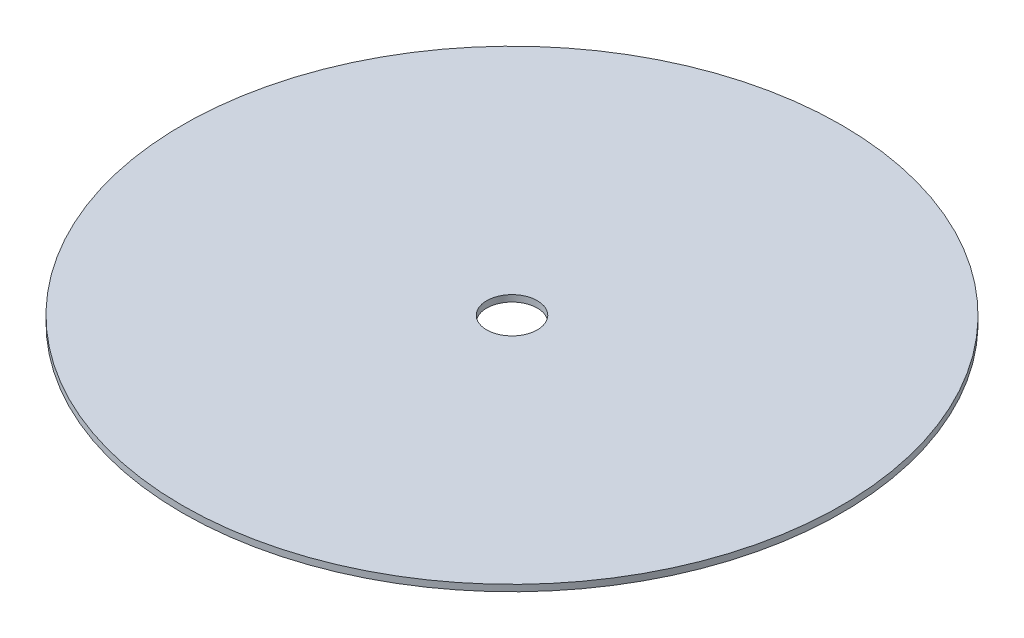
ISO-10303-21;
HEADER;
FILE_DESCRIPTION(('STEP AP214'),'2;1');
FILE_NAME('part.step','',(''),(''),'','','');
FILE_SCHEMA(('AUTOMOTIVE_DESIGN { 1 0 10303 214 1 1 1 1 }'));
ENDSEC;
DATA;
#1=APPLICATION_CONTEXT('core data for automotive mechanical design processes');
#2=APPLICATION_PROTOCOL_DEFINITION('international standard','automotive_design',2000,#1);
#3=PRODUCT_CONTEXT('',#1,'mechanical');
#4=PRODUCT('Part','Part','',(#3));
#5=PRODUCT_RELATED_PRODUCT_CATEGORY('part','',(#4));
#6=PRODUCT_DEFINITION_FORMATION('','',#4);
#7=PRODUCT_DEFINITION_CONTEXT('part definition',#1,'design');
#8=PRODUCT_DEFINITION('design','',#6,#7);
#9=PRODUCT_DEFINITION_SHAPE('','',#8);
#10=(LENGTH_UNIT() NAMED_UNIT(*) SI_UNIT(.MILLI.,.METRE.));
#11=(NAMED_UNIT(*) PLANE_ANGLE_UNIT() SI_UNIT($,.RADIAN.));
#12=(NAMED_UNIT(*) SI_UNIT($,.STERADIAN.) SOLID_ANGLE_UNIT());
#13=UNCERTAINTY_MEASURE_WITH_UNIT(LENGTH_MEASURE(1.E-05),#10,'distance_accuracy_value','');
#14=(GEOMETRIC_REPRESENTATION_CONTEXT(3) GLOBAL_UNCERTAINTY_ASSIGNED_CONTEXT((#13)) GLOBAL_UNIT_ASSIGNED_CONTEXT((#10,
#11,#12)) REPRESENTATION_CONTEXT('',''));
#15=CARTESIAN_POINT('',(0.,0.,0.));
#16=DIRECTION('',(0.,0.,1.));
#17=DIRECTION('',(1.,0.,0.));
#18=AXIS2_PLACEMENT_3D('',#15,#16,#17);
#19=CARTESIAN_POINT('',(0.,3.,0.));
#20=DIRECTION('',(0.,1.,0.));
#21=DIRECTION('',(0.,0.,1.));
#22=AXIS2_PLACEMENT_3D('',#19,#20,#21);
#23=PLANE('',#22);
#24=CARTESIAN_POINT('',(0.,3.,0.));
#25=DIRECTION('',(0.,1.,0.));
#26=DIRECTION('',(0.,0.,1.));
#27=AXIS2_PLACEMENT_3D('',#24,#25,#26);
#28=CIRCLE('',#27,153.);
#29=CARTESIAN_POINT('',(0.,3.,153.));
#30=VERTEX_POINT('',#29);
#31=EDGE_CURVE('E10',#30,#30,#28,.T.);
#32=ORIENTED_EDGE('',*,*,#31,.T.);
#33=EDGE_LOOP('',(#32));
#34=FACE_BOUND('',#33,.T.);
#35=CARTESIAN_POINT('',(0.,3.,0.));
#36=DIRECTION('',(0.,1.,0.));
#37=DIRECTION('',(0.,0.,1.));
#38=AXIS2_PLACEMENT_3D('',#35,#36,#37);
#39=CIRCLE('',#38,11.75);
#40=CARTESIAN_POINT('',(0.,3.,11.75));
#41=VERTEX_POINT('',#40);
#42=EDGE_CURVE('E56',#41,#41,#39,.T.);
#43=ORIENTED_EDGE('',*,*,#42,.F.);
#44=EDGE_LOOP('',(#43));
#45=FACE_BOUND('',#44,.T.);
#46=ADVANCED_FACE('F43',(#34,#45),#23,.T.);
#47=CARTESIAN_POINT('',(0.,0.,0.));
#48=DIRECTION('',(0.,1.,0.));
#49=DIRECTION('',(0.,0.,1.));
#50=AXIS2_PLACEMENT_3D('',#47,#48,#49);
#51=PLANE('',#50);
#52=CARTESIAN_POINT('',(0.,0.,0.));
#53=DIRECTION('',(0.,1.,0.));
#54=DIRECTION('',(0.,0.,1.));
#55=AXIS2_PLACEMENT_3D('',#52,#53,#54);
#56=CIRCLE('',#55,153.);
#57=CARTESIAN_POINT('',(0.,0.,153.));
#58=VERTEX_POINT('',#57);
#59=EDGE_CURVE('E47',#58,#58,#56,.T.);
#60=ORIENTED_EDGE('',*,*,#59,.F.);
#61=EDGE_LOOP('',(#60));
#62=FACE_BOUND('',#61,.T.);
#63=CARTESIAN_POINT('',(0.,0.,0.));
#64=DIRECTION('',(0.,1.,0.));
#65=DIRECTION('',(0.,0.,1.));
#66=AXIS2_PLACEMENT_3D('',#63,#64,#65);
#67=CIRCLE('',#66,11.75);
#68=CARTESIAN_POINT('',(0.,0.,11.75));
#69=VERTEX_POINT('',#68);
#70=EDGE_CURVE('E58',#69,#69,#67,.T.);
#71=ORIENTED_EDGE('',*,*,#70,.T.);
#72=EDGE_LOOP('',(#71));
#73=FACE_BOUND('',#72,.T.);
#74=ADVANCED_FACE('F70',(#62,#73),#51,.F.);
#75=CARTESIAN_POINT('',(0.,3.,0.));
#76=DIRECTION('',(0.,-1.,0.));
#77=DIRECTION('',(0.,0.,-1.));
#78=AXIS2_PLACEMENT_3D('',#75,#76,#77);
#79=CYLINDRICAL_SURFACE('',#78,153.);
#80=ORIENTED_EDGE('',*,*,#31,.F.);
#81=EDGE_LOOP('',(#80));
#82=FACE_BOUND('',#81,.T.);
#83=ORIENTED_EDGE('',*,*,#59,.T.);
#84=EDGE_LOOP('',(#83));
#85=FACE_BOUND('',#84,.T.);
#86=ADVANCED_FACE('F45',(#82,#85),#79,.T.);
#87=CARTESIAN_POINT('',(0.,3.,0.));
#88=DIRECTION('',(0.,-1.,0.));
#89=DIRECTION('',(0.,0.,-1.));
#90=AXIS2_PLACEMENT_3D('',#87,#88,#89);
#91=CYLINDRICAL_SURFACE('',#90,11.75);
#92=ORIENTED_EDGE('',*,*,#42,.T.);
#93=EDGE_LOOP('',(#92));
#94=FACE_BOUND('',#93,.T.);
#95=ORIENTED_EDGE('',*,*,#70,.F.);
#96=EDGE_LOOP('',(#95));
#97=FACE_BOUND('',#96,.T.);
#98=ADVANCED_FACE('F66',(#94,#97),#91,.F.);
#99=CLOSED_SHELL('',(#46,#74,#86,#98));
#100=MANIFOLD_SOLID_BREP('B2',#99);
#101=ADVANCED_BREP_SHAPE_REPRESENTATION('',(#18,#100),#14);
#102=SHAPE_DEFINITION_REPRESENTATION(#9,#101);
ENDSEC;
END-ISO-10303-21;
